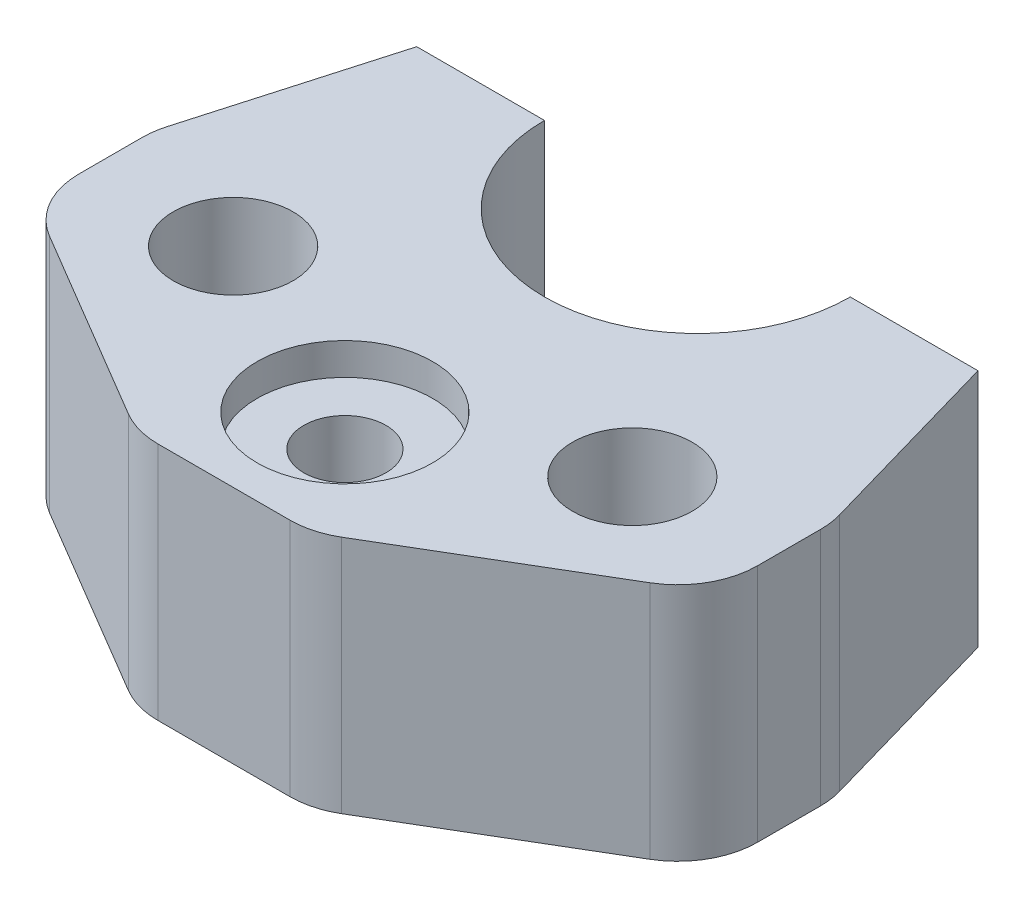
ISO-10303-21;
HEADER;
FILE_DESCRIPTION(('STEP AP214'),'2;1');
FILE_NAME('part.step','',(''),(''),'','','');
FILE_SCHEMA(('AUTOMOTIVE_DESIGN { 1 0 10303 214 1 1 1 1 }'));
ENDSEC;
DATA;
#1=APPLICATION_CONTEXT('core data for automotive mechanical design processes');
#2=APPLICATION_PROTOCOL_DEFINITION('international standard','automotive_design',2000,#1);
#3=PRODUCT_CONTEXT('',#1,'mechanical');
#4=PRODUCT('Part','Part','',(#3));
#5=PRODUCT_RELATED_PRODUCT_CATEGORY('part','',(#4));
#6=PRODUCT_DEFINITION_FORMATION('','',#4);
#7=PRODUCT_DEFINITION_CONTEXT('part definition',#1,'design');
#8=PRODUCT_DEFINITION('design','',#6,#7);
#9=PRODUCT_DEFINITION_SHAPE('','',#8);
#10=(LENGTH_UNIT() NAMED_UNIT(*) SI_UNIT(.MILLI.,.METRE.));
#11=(NAMED_UNIT(*) PLANE_ANGLE_UNIT() SI_UNIT($,.RADIAN.));
#12=(NAMED_UNIT(*) SI_UNIT($,.STERADIAN.) SOLID_ANGLE_UNIT());
#13=UNCERTAINTY_MEASURE_WITH_UNIT(LENGTH_MEASURE(1.E-05),#10,'distance_accuracy_value','');
#14=(GEOMETRIC_REPRESENTATION_CONTEXT(3) GLOBAL_UNCERTAINTY_ASSIGNED_CONTEXT((#13)) GLOBAL_UNIT_ASSIGNED_CONTEXT((#10,
#11,#12)) REPRESENTATION_CONTEXT('',''));
#15=CARTESIAN_POINT('',(0.,0.,0.));
#16=DIRECTION('',(0.,0.,1.));
#17=DIRECTION('',(1.,0.,0.));
#18=AXIS2_PLACEMENT_3D('',#15,#16,#17);
#19=CARTESIAN_POINT('',(0.,30.,44.15));
#20=DIRECTION('',(0.,-1.,0.));
#21=DIRECTION('',(0.,0.,-1.));
#22=AXIS2_PLACEMENT_3D('',#19,#20,#21);
#23=CYLINDRICAL_SURFACE('',#22,5.15);
#24=CARTESIAN_POINT('',(0.,0.,44.15));
#25=DIRECTION('',(0.,1.,0.));
#26=DIRECTION('',(0.,0.,1.));
#27=AXIS2_PLACEMENT_3D('',#24,#25,#26);
#28=CIRCLE('',#27,5.15);
#29=CARTESIAN_POINT('',(0.,0.,49.3));
#30=VERTEX_POINT('',#29);
#31=EDGE_CURVE('E203',#30,#30,#28,.T.);
#32=ORIENTED_EDGE('',*,*,#31,.F.);
#33=EDGE_LOOP('',(#32));
#34=FACE_BOUND('',#33,.T.);
#35=CARTESIAN_POINT('',(0.,26.,44.15));
#36=DIRECTION('',(0.,1.,0.));
#37=DIRECTION('',(0.,0.,1.));
#38=AXIS2_PLACEMENT_3D('',#35,#36,#37);
#39=CIRCLE('',#38,5.15);
#40=CARTESIAN_POINT('',(0.,26.,49.3));
#41=VERTEX_POINT('',#40);
#42=EDGE_CURVE('E40',#41,#41,#39,.T.);
#43=ORIENTED_EDGE('',*,*,#42,.T.);
#44=EDGE_LOOP('',(#43));
#45=FACE_BOUND('',#44,.T.);
#46=ADVANCED_FACE('F36',(#34,#45),#23,.F.);
#47=CARTESIAN_POINT('',(0.,30.,0.));
#48=DIRECTION('',(0.,0.,1.));
#49=DIRECTION('',(1.,0.,0.));
#50=AXIS2_PLACEMENT_3D('',#47,#48,#49);
#51=PLANE('',#50);
#52=DIRECTION('',(-1.,0.,0.));
#53=VECTOR('',#52,1.);
#54=CARTESIAN_POINT('',(0.,0.,0.));
#55=LINE('',#54,#53);
#56=CARTESIAN_POINT('',(35.15,0.,0.));
#57=VERTEX_POINT('',#56);
#58=CARTESIAN_POINT('',(19.15,0.,0.));
#59=VERTEX_POINT('',#58);
#60=EDGE_CURVE('E165',#57,#59,#55,.T.);
#61=ORIENTED_EDGE('',*,*,#60,.T.);
#62=DIRECTION('',(0.,-1.,0.));
#63=VECTOR('',#62,1.);
#64=CARTESIAN_POINT('',(19.15,30.,0.));
#65=LINE('',#64,#63);
#66=CARTESIAN_POINT('',(19.15,30.,0.));
#67=VERTEX_POINT('',#66);
#68=EDGE_CURVE('E162',#67,#59,#65,.T.);
#69=ORIENTED_EDGE('',*,*,#68,.F.);
#70=DIRECTION('',(-1.,0.,0.));
#71=VECTOR('',#70,1.);
#72=CARTESIAN_POINT('',(0.,30.,0.));
#73=LINE('',#72,#71);
#74=CARTESIAN_POINT('',(35.15,30.,0.));
#75=VERTEX_POINT('',#74);
#76=EDGE_CURVE('E150',#75,#67,#73,.T.);
#77=ORIENTED_EDGE('',*,*,#76,.F.);
#78=DIRECTION('',(0.,-1.,0.));
#79=VECTOR('',#78,1.);
#80=CARTESIAN_POINT('',(35.15,30.,0.));
#81=LINE('',#80,#79);
#82=EDGE_CURVE('E202',#75,#57,#81,.T.);
#83=ORIENTED_EDGE('',*,*,#82,.T.);
#84=EDGE_LOOP('',(#61,#69,#77,#83));
#85=FACE_BOUND('',#84,.T.);
#86=ADVANCED_FACE('F163',(#85),#51,.F.);
#87=CARTESIAN_POINT('',(0.,30.,0.));
#88=DIRECTION('',(0.,-1.,0.));
#89=DIRECTION('',(0.,0.,-1.));
#90=AXIS2_PLACEMENT_3D('',#87,#88,#89);
#91=CYLINDRICAL_SURFACE('',#90,19.15);
#92=CARTESIAN_POINT('',(0.,0.,0.));
#93=DIRECTION('',(0.,1.,0.));
#94=DIRECTION('',(0.,0.,1.));
#95=AXIS2_PLACEMENT_3D('',#92,#93,#94);
#96=CIRCLE('',#95,19.15);
#97=CARTESIAN_POINT('',(-19.15,0.,0.));
#98=VERTEX_POINT('',#97);
#99=EDGE_CURVE('E207',#98,#59,#96,.T.);
#100=ORIENTED_EDGE('',*,*,#99,.F.);
#101=DIRECTION('',(0.,-1.,0.));
#102=VECTOR('',#101,1.);
#103=CARTESIAN_POINT('',(-19.15,30.,0.));
#104=LINE('',#103,#102);
#105=CARTESIAN_POINT('',(-19.15,30.,0.));
#106=VERTEX_POINT('',#105);
#107=EDGE_CURVE('E170',#106,#98,#104,.T.);
#108=ORIENTED_EDGE('',*,*,#107,.F.);
#109=CARTESIAN_POINT('',(0.,30.,0.));
#110=DIRECTION('',(0.,1.,0.));
#111=DIRECTION('',(0.,0.,1.));
#112=AXIS2_PLACEMENT_3D('',#109,#110,#111);
#113=CIRCLE('',#112,19.15);
#114=EDGE_CURVE('E156',#106,#67,#113,.T.);
#115=ORIENTED_EDGE('',*,*,#114,.T.);
#116=ORIENTED_EDGE('',*,*,#68,.T.);
#117=EDGE_LOOP('',(#100,#108,#115,#116));
#118=FACE_BOUND('',#117,.T.);
#119=ADVANCED_FACE('F172',(#118),#91,.F.);
#120=CARTESIAN_POINT('',(0.,30.,0.));
#121=DIRECTION('',(0.,0.,1.));
#122=DIRECTION('',(1.,0.,0.));
#123=AXIS2_PLACEMENT_3D('',#120,#121,#122);
#124=PLANE('',#123);
#125=DIRECTION('',(-1.,0.,0.));
#126=VECTOR('',#125,1.);
#127=CARTESIAN_POINT('',(0.,0.,0.));
#128=LINE('',#127,#126);
#129=CARTESIAN_POINT('',(-35.15,0.,0.));
#130=VERTEX_POINT('',#129);
#131=EDGE_CURVE('E209',#98,#130,#128,.T.);
#132=ORIENTED_EDGE('',*,*,#131,.T.);
#133=DIRECTION('',(0.,-1.,0.));
#134=VECTOR('',#133,1.);
#135=CARTESIAN_POINT('',(-35.15,30.,0.));
#136=LINE('',#135,#134);
#137=CARTESIAN_POINT('',(-35.15,30.,0.));
#138=VERTEX_POINT('',#137);
#139=EDGE_CURVE('E238',#138,#130,#136,.T.);
#140=ORIENTED_EDGE('',*,*,#139,.F.);
#141=DIRECTION('',(-1.,0.,0.));
#142=VECTOR('',#141,1.);
#143=CARTESIAN_POINT('',(0.,30.,0.));
#144=LINE('',#143,#142);
#145=EDGE_CURVE('E174',#106,#138,#144,.T.);
#146=ORIENTED_EDGE('',*,*,#145,.F.);
#147=ORIENTED_EDGE('',*,*,#107,.T.);
#148=EDGE_LOOP('',(#132,#140,#146,#147));
#149=FACE_BOUND('',#148,.T.);
#150=ADVANCED_FACE('F327',(#149),#124,.F.);
#151=CARTESIAN_POINT('',(-32.4828124012388,30.,-9.30794039567665));
#152=DIRECTION('',(0.961311521161602,0.,0.275463535303618));
#153=DIRECTION('',(0.275463535303618,0.,-0.961311521161602));
#154=AXIS2_PLACEMENT_3D('',#151,#152,#153);
#155=PLANE('',#154);
#156=DIRECTION('',(-0.275463535303618,0.,0.961311521161602));
#157=VECTOR('',#156,1.);
#158=CARTESIAN_POINT('',(-32.4828124012388,0.,-9.30794039567665));
#159=LINE('',#158,#157);
#160=CARTESIAN_POINT('',(-42.113115211616,0.,24.2998510446192));
#161=VERTEX_POINT('',#160);
#162=EDGE_CURVE('E211',#130,#161,#159,.T.);
#163=ORIENTED_EDGE('',*,*,#162,.T.);
#164=DIRECTION('',(0.,-1.,0.));
#165=VECTOR('',#164,1.);
#166=CARTESIAN_POINT('',(-42.113115211616,30.,24.2998510446192));
#167=LINE('',#166,#165);
#168=CARTESIAN_POINT('',(-42.113115211616,30.,24.2998510446192));
#169=VERTEX_POINT('',#168);
#170=EDGE_CURVE('E258',#161,#169,#167,.F.);
#171=ORIENTED_EDGE('',*,*,#170,.T.);
#172=DIRECTION('',(-0.275463535303618,0.,0.961311521161602));
#173=VECTOR('',#172,1.);
#174=CARTESIAN_POINT('',(-32.4828124012388,30.,-9.30794039567665));
#175=LINE('',#174,#173);
#176=EDGE_CURVE('E176',#138,#169,#175,.T.);
#177=ORIENTED_EDGE('',*,*,#176,.F.);
#178=ORIENTED_EDGE('',*,*,#139,.T.);
#179=EDGE_LOOP('',(#163,#171,#177,#178));
#180=FACE_BOUND('',#179,.T.);
#181=ADVANCED_FACE('F330',(#180),#155,.F.);
#182=CARTESIAN_POINT('',(-42.5,30.,0.));
#183=DIRECTION('',(1.,0.,0.));
#184=DIRECTION('',(0.,0.,-1.));
#185=AXIS2_PLACEMENT_3D('',#182,#183,#184);
#186=PLANE('',#185);
#187=DIRECTION('',(0.,0.,1.));
#188=VECTOR('',#187,1.);
#189=CARTESIAN_POINT('',(-42.5,30.,0.));
#190=LINE('',#189,#188);
#191=CARTESIAN_POINT('',(-42.5,30.,27.0544863976553));
#192=VERTEX_POINT('',#191);
#193=CARTESIAN_POINT('',(-42.5,30.,34.949364858226));
#194=VERTEX_POINT('',#193);
#195=EDGE_CURVE('E181',#192,#194,#190,.T.);
#196=ORIENTED_EDGE('',*,*,#195,.F.);
#197=DIRECTION('',(0.,-1.,0.));
#198=VECTOR('',#197,1.);
#199=CARTESIAN_POINT('',(-42.5,30.,27.0544863976553));
#200=LINE('',#199,#198);
#201=CARTESIAN_POINT('',(-42.5,0.,27.0544863976553));
#202=VERTEX_POINT('',#201);
#203=EDGE_CURVE('E243',#192,#202,#200,.T.);
#204=ORIENTED_EDGE('',*,*,#203,.T.);
#205=DIRECTION('',(0.,0.,1.));
#206=VECTOR('',#205,1.);
#207=CARTESIAN_POINT('',(-42.5,0.,0.));
#208=LINE('',#207,#206);
#209=CARTESIAN_POINT('',(-42.5,0.,34.949364858226));
#210=VERTEX_POINT('',#209);
#211=EDGE_CURVE('E214',#202,#210,#208,.T.);
#212=ORIENTED_EDGE('',*,*,#211,.T.);
#213=DIRECTION('',(0.,-1.,0.));
#214=VECTOR('',#213,1.);
#215=CARTESIAN_POINT('',(-42.5,30.,34.949364858226));
#216=LINE('',#215,#214);
#217=EDGE_CURVE('E169',#210,#194,#216,.F.);
#218=ORIENTED_EDGE('',*,*,#217,.T.);
#219=EDGE_LOOP('',(#196,#204,#212,#218));
#220=FACE_BOUND('',#219,.T.);
#221=ADVANCED_FACE('F338',(#220),#186,.F.);
#222=CARTESIAN_POINT('',(-28.8516591453074,30.,48.7306843473021));
#223=DIRECTION('',(0.50946539309729,0.,-0.86049114651821));
#224=DIRECTION('',(-0.86049114651821,0.,-0.50946539309729));
#225=AXIS2_PLACEMENT_3D('',#222,#223,#224);
#226=PLANE('',#225);
#227=DIRECTION('',(0.86049114651821,0.,0.50946539309729));
#228=VECTOR('',#227,1.);
#229=CARTESIAN_POINT('',(-28.8516591453074,30.,48.7306843473021));
#230=LINE('',#229,#228);
#231=CARTESIAN_POINT('',(-37.5946539309729,30.,43.5542763234081));
#232=VERTEX_POINT('',#231);
#233=CARTESIAN_POINT('',(-13.3563157558586,30.,57.9049114651821));
#234=VERTEX_POINT('',#233);
#235=EDGE_CURVE('E184',#232,#234,#230,.T.);
#236=ORIENTED_EDGE('',*,*,#235,.F.);
#237=DIRECTION('',(0.,-1.,0.));
#238=VECTOR('',#237,1.);
#239=CARTESIAN_POINT('',(-37.5946539309729,30.,43.5542763234081));
#240=LINE('',#239,#238);
#241=CARTESIAN_POINT('',(-37.5946539309729,0.,43.5542763234081));
#242=VERTEX_POINT('',#241);
#243=EDGE_CURVE('E272',#232,#242,#240,.T.);
#244=ORIENTED_EDGE('',*,*,#243,.T.);
#245=DIRECTION('',(0.86049114651821,0.,0.50946539309729));
#246=VECTOR('',#245,1.);
#247=CARTESIAN_POINT('',(-28.8516591453074,0.,48.7306843473021));
#248=LINE('',#247,#246);
#249=CARTESIAN_POINT('',(-13.3563157558586,0.,57.9049114651821));
#250=VERTEX_POINT('',#249);
#251=EDGE_CURVE('E217',#242,#250,#248,.T.);
#252=ORIENTED_EDGE('',*,*,#251,.T.);
#253=DIRECTION('',(0.,-1.,0.));
#254=VECTOR('',#253,1.);
#255=CARTESIAN_POINT('',(-13.3563157558586,30.,57.9049114651821));
#256=LINE('',#255,#254);
#257=EDGE_CURVE('E270',#250,#234,#256,.F.);
#258=ORIENTED_EDGE('',*,*,#257,.T.);
#259=EDGE_LOOP('',(#236,#244,#252,#258));
#260=FACE_BOUND('',#259,.T.);
#261=ADVANCED_FACE('F346',(#260),#226,.F.);
#262=CARTESIAN_POINT('',(0.,30.,59.3));
#263=DIRECTION('',(0.,0.,-1.));
#264=DIRECTION('',(-1.,0.,0.));
#265=AXIS2_PLACEMENT_3D('',#262,#263,#264);
#266=PLANE('',#265);
#267=DIRECTION('',(1.,0.,0.));
#268=VECTOR('',#267,1.);
#269=CARTESIAN_POINT('',(0.,0.,59.3));
#270=LINE('',#269,#268);
#271=CARTESIAN_POINT('',(-8.26166182488574,0.,59.3));
#272=VERTEX_POINT('',#271);
#273=CARTESIAN_POINT('',(8.26166182488575,0.,59.3));
#274=VERTEX_POINT('',#273);
#275=EDGE_CURVE('E220',#272,#274,#270,.T.);
#276=ORIENTED_EDGE('',*,*,#275,.T.);
#277=DIRECTION('',(0.,-1.,0.));
#278=VECTOR('',#277,1.);
#279=CARTESIAN_POINT('',(8.26166182488575,30.,59.3));
#280=LINE('',#279,#278);
#281=CARTESIAN_POINT('',(8.26166182488575,30.,59.3));
#282=VERTEX_POINT('',#281);
#283=EDGE_CURVE('E11',#274,#282,#280,.F.);
#284=ORIENTED_EDGE('',*,*,#283,.T.);
#285=DIRECTION('',(1.,0.,0.));
#286=VECTOR('',#285,1.);
#287=CARTESIAN_POINT('',(0.,30.,59.3));
#288=LINE('',#287,#286);
#289=CARTESIAN_POINT('',(-8.26166182488574,30.,59.3));
#290=VERTEX_POINT('',#289);
#291=EDGE_CURVE('E187',#290,#282,#288,.T.);
#292=ORIENTED_EDGE('',*,*,#291,.F.);
#293=DIRECTION('',(0.,-1.,0.));
#294=VECTOR('',#293,1.);
#295=CARTESIAN_POINT('',(-8.26166182488574,30.,59.3));
#296=LINE('',#295,#294);
#297=EDGE_CURVE('E45',#290,#272,#296,.T.);
#298=ORIENTED_EDGE('',*,*,#297,.T.);
#299=EDGE_LOOP('',(#276,#284,#292,#298));
#300=FACE_BOUND('',#299,.T.);
#301=ADVANCED_FACE('F293',(#300),#266,.F.);
#302=CARTESIAN_POINT('',(28.8516591453075,30.,48.7306843473021));
#303=DIRECTION('',(0.50946539309729,0.,0.86049114651821));
#304=DIRECTION('',(0.86049114651821,0.,-0.50946539309729));
#305=AXIS2_PLACEMENT_3D('',#302,#303,#304);
#306=PLANE('',#305);
#307=DIRECTION('',(-0.86049114651821,0.,0.50946539309729));
#308=VECTOR('',#307,1.);
#309=CARTESIAN_POINT('',(28.8516591453075,0.,48.7306843473021));
#310=LINE('',#309,#308);
#311=CARTESIAN_POINT('',(37.5946539309729,0.,43.5542763234081));
#312=VERTEX_POINT('',#311);
#313=CARTESIAN_POINT('',(13.3563157558586,0.,57.9049114651821));
#314=VERTEX_POINT('',#313);
#315=EDGE_CURVE('E223',#312,#314,#310,.T.);
#316=ORIENTED_EDGE('',*,*,#315,.F.);
#317=DIRECTION('',(0.,-1.,0.));
#318=VECTOR('',#317,1.);
#319=CARTESIAN_POINT('',(37.5946539309729,30.,43.5542763234081));
#320=LINE('',#319,#318);
#321=CARTESIAN_POINT('',(37.5946539309729,30.,43.5542763234081));
#322=VERTEX_POINT('',#321);
#323=EDGE_CURVE('E286',#312,#322,#320,.F.);
#324=ORIENTED_EDGE('',*,*,#323,.T.);
#325=DIRECTION('',(-0.86049114651821,0.,0.50946539309729));
#326=VECTOR('',#325,1.);
#327=CARTESIAN_POINT('',(28.8516591453075,30.,48.7306843473021));
#328=LINE('',#327,#326);
#329=CARTESIAN_POINT('',(13.3563157558586,30.,57.9049114651821));
#330=VERTEX_POINT('',#329);
#331=EDGE_CURVE('E190',#322,#330,#328,.T.);
#332=ORIENTED_EDGE('',*,*,#331,.T.);
#333=DIRECTION('',(0.,-1.,0.));
#334=VECTOR('',#333,1.);
#335=CARTESIAN_POINT('',(13.3563157558587,0.,57.9049114651821));
#336=LINE('',#335,#334);
#337=EDGE_CURVE('E283',#330,#314,#336,.T.);
#338=ORIENTED_EDGE('',*,*,#337,.T.);
#339=EDGE_LOOP('',(#316,#324,#332,#338));
#340=FACE_BOUND('',#339,.T.);
#341=ADVANCED_FACE('F308',(#340),#306,.T.);
#342=CARTESIAN_POINT('',(42.5,30.,0.));
#343=DIRECTION('',(1.,0.,0.));
#344=DIRECTION('',(0.,0.,-1.));
#345=AXIS2_PLACEMENT_3D('',#342,#343,#344);
#346=PLANE('',#345);
#347=DIRECTION('',(0.,0.,1.));
#348=VECTOR('',#347,1.);
#349=CARTESIAN_POINT('',(42.5,0.,0.));
#350=LINE('',#349,#348);
#351=CARTESIAN_POINT('',(42.5,0.,27.0544863976553));
#352=VERTEX_POINT('',#351);
#353=CARTESIAN_POINT('',(42.5,0.,34.949364858226));
#354=VERTEX_POINT('',#353);
#355=EDGE_CURVE('E226',#352,#354,#350,.T.);
#356=ORIENTED_EDGE('',*,*,#355,.F.);
#357=DIRECTION('',(0.,-1.,0.));
#358=VECTOR('',#357,1.);
#359=CARTESIAN_POINT('',(42.5,30.,27.0544863976553));
#360=LINE('',#359,#358);
#361=CARTESIAN_POINT('',(42.5,30.,27.0544863976553));
#362=VERTEX_POINT('',#361);
#363=EDGE_CURVE('E281',#352,#362,#360,.F.);
#364=ORIENTED_EDGE('',*,*,#363,.T.);
#365=DIRECTION('',(0.,0.,1.));
#366=VECTOR('',#365,1.);
#367=CARTESIAN_POINT('',(42.5,30.,0.));
#368=LINE('',#367,#366);
#369=CARTESIAN_POINT('',(42.5,30.,34.949364858226));
#370=VERTEX_POINT('',#369);
#371=EDGE_CURVE('E193',#362,#370,#368,.T.);
#372=ORIENTED_EDGE('',*,*,#371,.T.);
#373=DIRECTION('',(0.,-1.,0.));
#374=VECTOR('',#373,1.);
#375=CARTESIAN_POINT('',(42.5,30.,34.949364858226));
#376=LINE('',#375,#374);
#377=EDGE_CURVE('E278',#370,#354,#376,.T.);
#378=ORIENTED_EDGE('',*,*,#377,.T.);
#379=EDGE_LOOP('',(#356,#364,#372,#378));
#380=FACE_BOUND('',#379,.T.);
#381=ADVANCED_FACE('F315',(#380),#346,.T.);
#382=CARTESIAN_POINT('',(-25.,30.,33.15));
#383=DIRECTION('',(0.,-1.,0.));
#384=DIRECTION('',(0.,0.,-1.));
#385=AXIS2_PLACEMENT_3D('',#382,#383,#384);
#386=CYLINDRICAL_SURFACE('',#385,7.5);
#387=CARTESIAN_POINT('',(-25.,30.,33.15));
#388=DIRECTION('',(0.,1.,0.));
#389=DIRECTION('',(0.,0.,1.));
#390=AXIS2_PLACEMENT_3D('',#387,#388,#389);
#391=CIRCLE('',#390,7.5);
#392=CARTESIAN_POINT('',(-25.,30.,40.65));
#393=VERTEX_POINT('',#392);
#394=EDGE_CURVE('E196',#393,#393,#391,.T.);
#395=ORIENTED_EDGE('',*,*,#394,.T.);
#396=EDGE_LOOP('',(#395));
#397=FACE_BOUND('',#396,.T.);
#398=CARTESIAN_POINT('',(-25.,0.,33.15));
#399=DIRECTION('',(0.,1.,0.));
#400=DIRECTION('',(0.,0.,1.));
#401=AXIS2_PLACEMENT_3D('',#398,#399,#400);
#402=CIRCLE('',#401,7.5);
#403=CARTESIAN_POINT('',(-25.,0.,40.65));
#404=VERTEX_POINT('',#403);
#405=EDGE_CURVE('E232',#404,#404,#402,.T.);
#406=ORIENTED_EDGE('',*,*,#405,.F.);
#407=EDGE_LOOP('',(#406));
#408=FACE_BOUND('',#407,.T.);
#409=ADVANCED_FACE('F431',(#397,#408),#386,.F.);
#410=CARTESIAN_POINT('',(32.4828124012388,30.,-9.30794039567665));
#411=DIRECTION('',(0.961311521161602,0.,-0.275463535303618));
#412=DIRECTION('',(-0.275463535303618,0.,-0.961311521161602));
#413=AXIS2_PLACEMENT_3D('',#410,#411,#412);
#414=PLANE('',#413);
#415=DIRECTION('',(0.275463535303618,0.,0.961311521161602));
#416=VECTOR('',#415,1.);
#417=CARTESIAN_POINT('',(32.4828124012388,30.,-9.30794039567665));
#418=LINE('',#417,#416);
#419=CARTESIAN_POINT('',(42.113115211616,30.,24.2998510446192));
#420=VERTEX_POINT('',#419);
#421=EDGE_CURVE('E157',#75,#420,#418,.T.);
#422=ORIENTED_EDGE('',*,*,#421,.T.);
#423=DIRECTION('',(0.,-1.,0.));
#424=VECTOR('',#423,1.);
#425=CARTESIAN_POINT('',(42.113115211616,30.,24.2998510446192));
#426=LINE('',#425,#424);
#427=CARTESIAN_POINT('',(42.113115211616,0.,24.2998510446192));
#428=VERTEX_POINT('',#427);
#429=EDGE_CURVE('E275',#420,#428,#426,.T.);
#430=ORIENTED_EDGE('',*,*,#429,.T.);
#431=DIRECTION('',(0.275463535303618,0.,0.961311521161602));
#432=VECTOR('',#431,1.);
#433=CARTESIAN_POINT('',(32.4828124012388,0.,-9.30794039567665));
#434=LINE('',#433,#432);
#435=EDGE_CURVE('E229',#57,#428,#434,.T.);
#436=ORIENTED_EDGE('',*,*,#435,.F.);
#437=ORIENTED_EDGE('',*,*,#82,.F.);
#438=EDGE_LOOP('',(#422,#430,#436,#437));
#439=FACE_BOUND('',#438,.T.);
#440=ADVANCED_FACE('F322',(#439),#414,.T.);
#441=CARTESIAN_POINT('',(25.,30.,33.15));
#442=DIRECTION('',(0.,-1.,0.));
#443=DIRECTION('',(0.,0.,-1.));
#444=AXIS2_PLACEMENT_3D('',#441,#442,#443);
#445=CYLINDRICAL_SURFACE('',#444,7.5);
#446=CARTESIAN_POINT('',(25.,30.,33.15));
#447=DIRECTION('',(0.,1.,0.));
#448=DIRECTION('',(0.,0.,1.));
#449=AXIS2_PLACEMENT_3D('',#446,#447,#448);
#450=CIRCLE('',#449,7.5);
#451=CARTESIAN_POINT('',(25.,30.,40.65));
#452=VERTEX_POINT('',#451);
#453=EDGE_CURVE('E199',#452,#452,#450,.F.);
#454=ORIENTED_EDGE('',*,*,#453,.F.);
#455=EDGE_LOOP('',(#454));
#456=FACE_BOUND('',#455,.T.);
#457=CARTESIAN_POINT('',(25.,0.,33.15));
#458=DIRECTION('',(0.,1.,0.));
#459=DIRECTION('',(0.,0.,1.));
#460=AXIS2_PLACEMENT_3D('',#457,#458,#459);
#461=CIRCLE('',#460,7.5);
#462=CARTESIAN_POINT('',(25.,0.,40.65));
#463=VERTEX_POINT('',#462);
#464=EDGE_CURVE('E159',#463,#463,#461,.F.);
#465=ORIENTED_EDGE('',*,*,#464,.T.);
#466=EDGE_LOOP('',(#465));
#467=FACE_BOUND('',#466,.T.);
#468=ADVANCED_FACE('F401',(#456,#467),#445,.F.);
#469=CARTESIAN_POINT('',(0.,30.,0.));
#470=DIRECTION('',(0.,1.,0.));
#471=DIRECTION('',(0.,0.,1.));
#472=AXIS2_PLACEMENT_3D('',#469,#470,#471);
#473=PLANE('',#472);
#474=CARTESIAN_POINT('',(0.,30.,44.15));
#475=DIRECTION('',(0.,1.,0.));
#476=DIRECTION('',(0.,0.,1.));
#477=AXIS2_PLACEMENT_3D('',#474,#475,#476);
#478=CIRCLE('',#477,11.);
#479=CARTESIAN_POINT('',(0.,30.,55.15));
#480=VERTEX_POINT('',#479);
#481=EDGE_CURVE('E575',#480,#480,#478,.T.);
#482=ORIENTED_EDGE('',*,*,#481,.F.);
#483=EDGE_LOOP('',(#482));
#484=FACE_BOUND('',#483,.T.);
#485=ORIENTED_EDGE('',*,*,#176,.T.);
#486=CARTESIAN_POINT('',(-32.5,30.,27.0544863976553));
#487=DIRECTION('',(0.,1.,0.));
#488=DIRECTION('',(0.,0.,1.));
#489=AXIS2_PLACEMENT_3D('',#486,#487,#488);
#490=CIRCLE('',#489,10.);
#491=EDGE_CURVE('E268',#169,#192,#490,.T.);
#492=ORIENTED_EDGE('',*,*,#491,.T.);
#493=ORIENTED_EDGE('',*,*,#195,.T.);
#494=CARTESIAN_POINT('',(-32.5,30.,34.949364858226));
#495=DIRECTION('',(0.,1.,0.));
#496=DIRECTION('',(0.,0.,1.));
#497=AXIS2_PLACEMENT_3D('',#494,#495,#496);
#498=CIRCLE('',#497,10.);
#499=EDGE_CURVE('E266',#194,#232,#498,.T.);
#500=ORIENTED_EDGE('',*,*,#499,.T.);
#501=ORIENTED_EDGE('',*,*,#235,.T.);
#502=CARTESIAN_POINT('',(-8.26166182488574,30.,49.3));
#503=DIRECTION('',(0.,1.,0.));
#504=DIRECTION('',(0.,0.,1.));
#505=AXIS2_PLACEMENT_3D('',#502,#503,#504);
#506=CIRCLE('',#505,10.);
#507=EDGE_CURVE('E260',#234,#290,#506,.T.);
#508=ORIENTED_EDGE('',*,*,#507,.T.);
#509=ORIENTED_EDGE('',*,*,#291,.T.);
#510=CARTESIAN_POINT('',(8.26166182488575,30.,49.3));
#511=DIRECTION('',(0.,1.,0.));
#512=DIRECTION('',(0.,0.,1.));
#513=AXIS2_PLACEMENT_3D('',#510,#511,#512);
#514=CIRCLE('',#513,10.);
#515=EDGE_CURVE('E262',#282,#330,#514,.T.);
#516=ORIENTED_EDGE('',*,*,#515,.T.);
#517=ORIENTED_EDGE('',*,*,#331,.F.);
#518=CARTESIAN_POINT('',(32.5,30.,34.949364858226));
#519=DIRECTION('',(0.,1.,0.));
#520=DIRECTION('',(0.,0.,1.));
#521=AXIS2_PLACEMENT_3D('',#518,#519,#520);
#522=CIRCLE('',#521,10.);
#523=EDGE_CURVE('E58',#322,#370,#522,.T.);
#524=ORIENTED_EDGE('',*,*,#523,.T.);
#525=ORIENTED_EDGE('',*,*,#371,.F.);
#526=CARTESIAN_POINT('',(32.5,30.,27.0544863976553));
#527=DIRECTION('',(0.,1.,0.));
#528=DIRECTION('',(0.,0.,1.));
#529=AXIS2_PLACEMENT_3D('',#526,#527,#528);
#530=CIRCLE('',#529,10.);
#531=EDGE_CURVE('E52',#362,#420,#530,.T.);
#532=ORIENTED_EDGE('',*,*,#531,.T.);
#533=ORIENTED_EDGE('',*,*,#421,.F.);
#534=ORIENTED_EDGE('',*,*,#76,.T.);
#535=ORIENTED_EDGE('',*,*,#114,.F.);
#536=ORIENTED_EDGE('',*,*,#145,.T.);
#537=EDGE_LOOP('',(#485,#492,#493,#500,#501,#508,#509,#516,#517,#524,#525,#532,#533,#534,#535,#536));
#538=FACE_BOUND('',#537,.T.);
#539=ORIENTED_EDGE('',*,*,#394,.F.);
#540=EDGE_LOOP('',(#539));
#541=FACE_BOUND('',#540,.T.);
#542=ORIENTED_EDGE('',*,*,#453,.T.);
#543=EDGE_LOOP('',(#542));
#544=FACE_BOUND('',#543,.T.);
#545=ADVANCED_FACE('F153',(#484,#538,#541,#544),#473,.T.);
#546=CARTESIAN_POINT('',(0.,0.,0.));
#547=DIRECTION('',(0.,1.,0.));
#548=DIRECTION('',(0.,0.,1.));
#549=AXIS2_PLACEMENT_3D('',#546,#547,#548);
#550=PLANE('',#549);
#551=ORIENTED_EDGE('',*,*,#31,.T.);
#552=EDGE_LOOP('',(#551));
#553=FACE_BOUND('',#552,.T.);
#554=ORIENTED_EDGE('',*,*,#211,.F.);
#555=CARTESIAN_POINT('',(-32.5,0.,27.0544863976553));
#556=DIRECTION('',(0.,1.,0.));
#557=DIRECTION('',(0.,0.,1.));
#558=AXIS2_PLACEMENT_3D('',#555,#556,#557);
#559=CIRCLE('',#558,10.);
#560=EDGE_CURVE('E256',#202,#161,#559,.F.);
#561=ORIENTED_EDGE('',*,*,#560,.T.);
#562=ORIENTED_EDGE('',*,*,#162,.F.);
#563=ORIENTED_EDGE('',*,*,#131,.F.);
#564=ORIENTED_EDGE('',*,*,#99,.T.);
#565=ORIENTED_EDGE('',*,*,#60,.F.);
#566=ORIENTED_EDGE('',*,*,#435,.T.);
#567=CARTESIAN_POINT('',(32.5,0.,27.0544863976553));
#568=DIRECTION('',(0.,1.,0.));
#569=DIRECTION('',(0.,0.,1.));
#570=AXIS2_PLACEMENT_3D('',#567,#568,#569);
#571=CIRCLE('',#570,10.);
#572=EDGE_CURVE('E252',#428,#352,#571,.F.);
#573=ORIENTED_EDGE('',*,*,#572,.T.);
#574=ORIENTED_EDGE('',*,*,#355,.T.);
#575=CARTESIAN_POINT('',(32.5,0.,34.949364858226));
#576=DIRECTION('',(0.,1.,0.));
#577=DIRECTION('',(0.,0.,1.));
#578=AXIS2_PLACEMENT_3D('',#575,#576,#577);
#579=CIRCLE('',#578,10.);
#580=EDGE_CURVE('E250',#354,#312,#579,.F.);
#581=ORIENTED_EDGE('',*,*,#580,.T.);
#582=ORIENTED_EDGE('',*,*,#315,.T.);
#583=CARTESIAN_POINT('',(8.26166182488575,0.,49.3));
#584=DIRECTION('',(0.,1.,0.));
#585=DIRECTION('',(0.,0.,1.));
#586=AXIS2_PLACEMENT_3D('',#583,#584,#585);
#587=CIRCLE('',#586,10.);
#588=EDGE_CURVE('E248',#314,#274,#587,.F.);
#589=ORIENTED_EDGE('',*,*,#588,.T.);
#590=ORIENTED_EDGE('',*,*,#275,.F.);
#591=CARTESIAN_POINT('',(-8.26166182488574,0.,49.3));
#592=DIRECTION('',(0.,1.,0.));
#593=DIRECTION('',(0.,0.,1.));
#594=AXIS2_PLACEMENT_3D('',#591,#592,#593);
#595=CIRCLE('',#594,10.);
#596=EDGE_CURVE('E246',#272,#250,#595,.F.);
#597=ORIENTED_EDGE('',*,*,#596,.T.);
#598=ORIENTED_EDGE('',*,*,#251,.F.);
#599=CARTESIAN_POINT('',(-32.5,0.,34.949364858226));
#600=DIRECTION('',(0.,1.,0.));
#601=DIRECTION('',(0.,0.,1.));
#602=AXIS2_PLACEMENT_3D('',#599,#600,#601);
#603=CIRCLE('',#602,10.);
#604=EDGE_CURVE('E254',#242,#210,#603,.F.);
#605=ORIENTED_EDGE('',*,*,#604,.T.);
#606=EDGE_LOOP('',(#554,#561,#562,#563,#564,#565,#566,#573,#574,#581,#582,#589,#590,#597,#598,#605));
#607=FACE_BOUND('',#606,.T.);
#608=ORIENTED_EDGE('',*,*,#405,.T.);
#609=EDGE_LOOP('',(#608));
#610=FACE_BOUND('',#609,.T.);
#611=ORIENTED_EDGE('',*,*,#464,.F.);
#612=EDGE_LOOP('',(#611));
#613=FACE_BOUND('',#612,.T.);
#614=ADVANCED_FACE('F299',(#553,#607,#610,#613),#550,.F.);
#615=CARTESIAN_POINT('',(-32.5,30.,27.0544863976553));
#616=DIRECTION('',(0.,-1.,0.));
#617=DIRECTION('',(0.,0.,-1.));
#618=AXIS2_PLACEMENT_3D('',#615,#616,#617);
#619=CYLINDRICAL_SURFACE('',#618,10.);
#620=ORIENTED_EDGE('',*,*,#491,.F.);
#621=ORIENTED_EDGE('',*,*,#170,.F.);
#622=ORIENTED_EDGE('',*,*,#560,.F.);
#623=ORIENTED_EDGE('',*,*,#203,.F.);
#624=EDGE_LOOP('',(#620,#621,#622,#623));
#625=FACE_BOUND('',#624,.T.);
#626=ADVANCED_FACE('F336',(#625),#619,.T.);
#627=CARTESIAN_POINT('',(-32.5,30.,34.949364858226));
#628=DIRECTION('',(0.,-1.,0.));
#629=DIRECTION('',(0.,0.,-1.));
#630=AXIS2_PLACEMENT_3D('',#627,#628,#629);
#631=CYLINDRICAL_SURFACE('',#630,10.);
#632=ORIENTED_EDGE('',*,*,#499,.F.);
#633=ORIENTED_EDGE('',*,*,#217,.F.);
#634=ORIENTED_EDGE('',*,*,#604,.F.);
#635=ORIENTED_EDGE('',*,*,#243,.F.);
#636=EDGE_LOOP('',(#632,#633,#634,#635));
#637=FACE_BOUND('',#636,.T.);
#638=ADVANCED_FACE('F343',(#637),#631,.T.);
#639=CARTESIAN_POINT('',(32.5,30.,27.0544863976553));
#640=DIRECTION('',(0.,-1.,0.));
#641=DIRECTION('',(0.,0.,-1.));
#642=AXIS2_PLACEMENT_3D('',#639,#640,#641);
#643=CYLINDRICAL_SURFACE('',#642,10.);
#644=ORIENTED_EDGE('',*,*,#531,.F.);
#645=ORIENTED_EDGE('',*,*,#363,.F.);
#646=ORIENTED_EDGE('',*,*,#572,.F.);
#647=ORIENTED_EDGE('',*,*,#429,.F.);
#648=EDGE_LOOP('',(#644,#645,#646,#647));
#649=FACE_BOUND('',#648,.T.);
#650=ADVANCED_FACE('F320',(#649),#643,.T.);
#651=CARTESIAN_POINT('',(32.5,30.,34.949364858226));
#652=DIRECTION('',(0.,-1.,0.));
#653=DIRECTION('',(0.,0.,-1.));
#654=AXIS2_PLACEMENT_3D('',#651,#652,#653);
#655=CYLINDRICAL_SURFACE('',#654,10.);
#656=ORIENTED_EDGE('',*,*,#523,.F.);
#657=ORIENTED_EDGE('',*,*,#323,.F.);
#658=ORIENTED_EDGE('',*,*,#580,.F.);
#659=ORIENTED_EDGE('',*,*,#377,.F.);
#660=EDGE_LOOP('',(#656,#657,#658,#659));
#661=FACE_BOUND('',#660,.T.);
#662=ADVANCED_FACE('F312',(#661),#655,.T.);
#663=CARTESIAN_POINT('',(8.26166182488575,30.,49.3));
#664=DIRECTION('',(0.,1.,0.));
#665=DIRECTION('',(0.,0.,1.));
#666=AXIS2_PLACEMENT_3D('',#663,#664,#665);
#667=CYLINDRICAL_SURFACE('',#666,10.);
#668=ORIENTED_EDGE('',*,*,#515,.F.);
#669=ORIENTED_EDGE('',*,*,#283,.F.);
#670=ORIENTED_EDGE('',*,*,#588,.F.);
#671=ORIENTED_EDGE('',*,*,#337,.F.);
#672=EDGE_LOOP('',(#668,#669,#670,#671));
#673=FACE_BOUND('',#672,.T.);
#674=ADVANCED_FACE('F306',(#673),#667,.T.);
#675=CARTESIAN_POINT('',(-8.26166182488574,30.,49.3));
#676=DIRECTION('',(0.,-1.,0.));
#677=DIRECTION('',(0.,0.,-1.));
#678=AXIS2_PLACEMENT_3D('',#675,#676,#677);
#679=CYLINDRICAL_SURFACE('',#678,10.);
#680=ORIENTED_EDGE('',*,*,#507,.F.);
#681=ORIENTED_EDGE('',*,*,#257,.F.);
#682=ORIENTED_EDGE('',*,*,#596,.F.);
#683=ORIENTED_EDGE('',*,*,#297,.F.);
#684=EDGE_LOOP('',(#680,#681,#682,#683));
#685=FACE_BOUND('',#684,.T.);
#686=ADVANCED_FACE('F38',(#685),#679,.T.);
#687=CARTESIAN_POINT('',(0.,26.,44.15));
#688=DIRECTION('',(0.,1.,0.));
#689=DIRECTION('',(0.,0.,1.));
#690=AXIS2_PLACEMENT_3D('',#687,#688,#689);
#691=CYLINDRICAL_SURFACE('',#690,11.);
#692=CARTESIAN_POINT('',(0.,26.,44.15));
#693=DIRECTION('',(0.,1.,0.));
#694=DIRECTION('',(0.,0.,1.));
#695=AXIS2_PLACEMENT_3D('',#692,#693,#694);
#696=CIRCLE('',#695,11.);
#697=CARTESIAN_POINT('',(0.,26.,55.15));
#698=VERTEX_POINT('',#697);
#699=EDGE_CURVE('E574',#698,#698,#696,.T.);
#700=ORIENTED_EDGE('',*,*,#699,.F.);
#701=EDGE_LOOP('',(#700));
#702=FACE_BOUND('',#701,.T.);
#703=ORIENTED_EDGE('',*,*,#481,.T.);
#704=EDGE_LOOP('',(#703));
#705=FACE_BOUND('',#704,.T.);
#706=ADVANCED_FACE('F349',(#702,#705),#691,.F.);
#707=CARTESIAN_POINT('',(0.,26.,44.15));
#708=DIRECTION('',(0.,1.,0.));
#709=DIRECTION('',(0.,0.,1.));
#710=AXIS2_PLACEMENT_3D('',#707,#708,#709);
#711=PLANE('',#710);
#712=ORIENTED_EDGE('',*,*,#42,.F.);
#713=EDGE_LOOP('',(#712));
#714=FACE_BOUND('',#713,.T.);
#715=ORIENTED_EDGE('',*,*,#699,.T.);
#716=EDGE_LOOP('',(#715));
#717=FACE_BOUND('',#716,.T.);
#718=ADVANCED_FACE('F354',(#714,#717),#711,.T.);
#719=CLOSED_SHELL('',(#46,#86,#119,#150,#181,#221,#261,#301,#341,#381,#409,#440,#468,#545,#614,
#626,#638,#650,#662,#674,#686,#706,#718));
#720=MANIFOLD_SOLID_BREP('B2',#719);
#721=ADVANCED_BREP_SHAPE_REPRESENTATION('',(#18,#720),#14);
#722=SHAPE_DEFINITION_REPRESENTATION(#9,#721);
ENDSEC;
END-ISO-10303-21;
